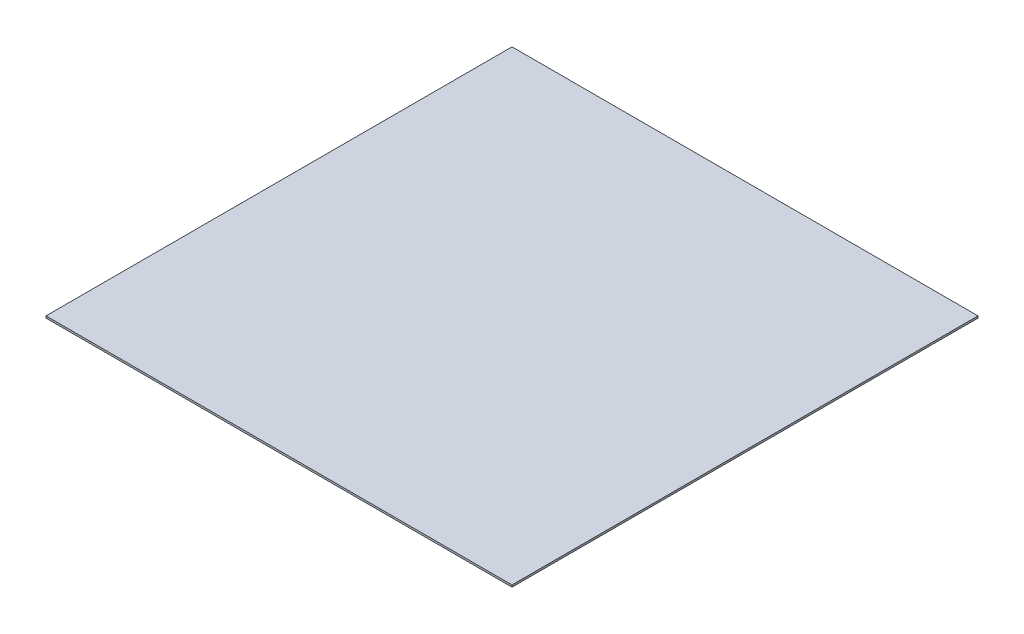
ISO-10303-21;
HEADER;
FILE_DESCRIPTION(('STEP AP214'),'2;1');
FILE_NAME('part.step','',(''),(''),'','','');
FILE_SCHEMA(('AUTOMOTIVE_DESIGN { 1 0 10303 214 1 1 1 1 }'));
ENDSEC;
DATA;
#1=APPLICATION_CONTEXT('core data for automotive mechanical design processes');
#2=APPLICATION_PROTOCOL_DEFINITION('international standard','automotive_design',2000,#1);
#3=PRODUCT_CONTEXT('',#1,'mechanical');
#4=PRODUCT('Part','Part','',(#3));
#5=PRODUCT_RELATED_PRODUCT_CATEGORY('part','',(#4));
#6=PRODUCT_DEFINITION_FORMATION('','',#4);
#7=PRODUCT_DEFINITION_CONTEXT('part definition',#1,'design');
#8=PRODUCT_DEFINITION('design','',#6,#7);
#9=PRODUCT_DEFINITION_SHAPE('','',#8);
#10=(LENGTH_UNIT() NAMED_UNIT(*) SI_UNIT(.MILLI.,.METRE.));
#11=(NAMED_UNIT(*) PLANE_ANGLE_UNIT() SI_UNIT($,.RADIAN.));
#12=(NAMED_UNIT(*) SI_UNIT($,.STERADIAN.) SOLID_ANGLE_UNIT());
#13=UNCERTAINTY_MEASURE_WITH_UNIT(LENGTH_MEASURE(1.E-05),#10,'distance_accuracy_value','');
#14=(GEOMETRIC_REPRESENTATION_CONTEXT(3) GLOBAL_UNCERTAINTY_ASSIGNED_CONTEXT((#13)) GLOBAL_UNIT_ASSIGNED_CONTEXT((#10,
#11,#12)) REPRESENTATION_CONTEXT('',''));
#15=CARTESIAN_POINT('',(0.,0.,0.));
#16=DIRECTION('',(0.,0.,1.));
#17=DIRECTION('',(1.,0.,0.));
#18=AXIS2_PLACEMENT_3D('',#15,#16,#17);
#19=CARTESIAN_POINT('',(762.,3.175,762.));
#20=DIRECTION('',(-1.,0.,0.));
#21=DIRECTION('',(0.,0.,1.));
#22=AXIS2_PLACEMENT_3D('',#19,#20,#21);
#23=PLANE('',#22);
#24=DIRECTION('',(0.,0.,-1.));
#25=VECTOR('',#24,1.);
#26=CARTESIAN_POINT('',(762.,-3.175,762.));
#27=LINE('',#26,#25);
#28=CARTESIAN_POINT('',(762.,-3.175,762.));
#29=VERTEX_POINT('',#28);
#30=CARTESIAN_POINT('',(762.,-3.175,-762.));
#31=VERTEX_POINT('',#30);
#32=EDGE_CURVE('E96',#29,#31,#27,.T.);
#33=ORIENTED_EDGE('',*,*,#32,.T.);
#34=DIRECTION('',(0.,-1.,0.));
#35=VECTOR('',#34,1.);
#36=CARTESIAN_POINT('',(762.,3.175,-762.));
#37=LINE('',#36,#35);
#38=CARTESIAN_POINT('',(762.,3.175,-762.));
#39=VERTEX_POINT('',#38);
#40=EDGE_CURVE('E11',#39,#31,#37,.T.);
#41=ORIENTED_EDGE('',*,*,#40,.F.);
#42=DIRECTION('',(0.,0.,-1.));
#43=VECTOR('',#42,1.);
#44=CARTESIAN_POINT('',(762.,3.175,762.));
#45=LINE('',#44,#43);
#46=CARTESIAN_POINT('',(762.,3.175,762.));
#47=VERTEX_POINT('',#46);
#48=EDGE_CURVE('E84',#47,#39,#45,.T.);
#49=ORIENTED_EDGE('',*,*,#48,.F.);
#50=DIRECTION('',(0.,-1.,0.));
#51=VECTOR('',#50,1.);
#52=CARTESIAN_POINT('',(762.,3.175,762.));
#53=LINE('',#52,#51);
#54=EDGE_CURVE('E92',#47,#29,#53,.T.);
#55=ORIENTED_EDGE('',*,*,#54,.T.);
#56=EDGE_LOOP('',(#33,#41,#49,#55));
#57=FACE_BOUND('',#56,.T.);
#58=ADVANCED_FACE('F33',(#57),#23,.F.);
#59=CARTESIAN_POINT('',(-762.,3.175,-762.));
#60=DIRECTION('',(0.,0.,1.));
#61=DIRECTION('',(1.,0.,0.));
#62=AXIS2_PLACEMENT_3D('',#59,#60,#61);
#63=PLANE('',#62);
#64=DIRECTION('',(-1.,0.,0.));
#65=VECTOR('',#64,1.);
#66=CARTESIAN_POINT('',(-762.,-3.175,-762.));
#67=LINE('',#66,#65);
#68=CARTESIAN_POINT('',(-762.,-3.175,-762.));
#69=VERTEX_POINT('',#68);
#70=EDGE_CURVE('E88',#31,#69,#67,.T.);
#71=ORIENTED_EDGE('',*,*,#70,.T.);
#72=DIRECTION('',(0.,-1.,0.));
#73=VECTOR('',#72,1.);
#74=CARTESIAN_POINT('',(-762.,3.175,-762.));
#75=LINE('',#74,#73);
#76=CARTESIAN_POINT('',(-762.,3.175,-762.));
#77=VERTEX_POINT('',#76);
#78=EDGE_CURVE('E41',#77,#69,#75,.T.);
#79=ORIENTED_EDGE('',*,*,#78,.F.);
#80=DIRECTION('',(-1.,0.,0.));
#81=VECTOR('',#80,1.);
#82=CARTESIAN_POINT('',(-762.,3.175,-762.));
#83=LINE('',#82,#81);
#84=EDGE_CURVE('E79',#39,#77,#83,.T.);
#85=ORIENTED_EDGE('',*,*,#84,.F.);
#86=ORIENTED_EDGE('',*,*,#40,.T.);
#87=EDGE_LOOP('',(#71,#79,#85,#86));
#88=FACE_BOUND('',#87,.T.);
#89=ADVANCED_FACE('F87',(#88),#63,.F.);
#90=CARTESIAN_POINT('',(-762.,3.175,762.));
#91=DIRECTION('',(1.,0.,0.));
#92=DIRECTION('',(0.,0.,-1.));
#93=AXIS2_PLACEMENT_3D('',#90,#91,#92);
#94=PLANE('',#93);
#95=DIRECTION('',(0.,0.,1.));
#96=VECTOR('',#95,1.);
#97=CARTESIAN_POINT('',(-762.,-3.175,762.));
#98=LINE('',#97,#96);
#99=CARTESIAN_POINT('',(-762.,-3.175,762.));
#100=VERTEX_POINT('',#99);
#101=EDGE_CURVE('E66',#69,#100,#98,.T.);
#102=ORIENTED_EDGE('',*,*,#101,.T.);
#103=DIRECTION('',(0.,-1.,0.));
#104=VECTOR('',#103,1.);
#105=CARTESIAN_POINT('',(-762.,3.175,762.));
#106=LINE('',#105,#104);
#107=CARTESIAN_POINT('',(-762.,3.175,762.));
#108=VERTEX_POINT('',#107);
#109=EDGE_CURVE('E89',#108,#100,#106,.T.);
#110=ORIENTED_EDGE('',*,*,#109,.F.);
#111=DIRECTION('',(0.,0.,1.));
#112=VECTOR('',#111,1.);
#113=CARTESIAN_POINT('',(-762.,3.175,762.));
#114=LINE('',#113,#112);
#115=EDGE_CURVE('E82',#77,#108,#114,.T.);
#116=ORIENTED_EDGE('',*,*,#115,.F.);
#117=ORIENTED_EDGE('',*,*,#78,.T.);
#118=EDGE_LOOP('',(#102,#110,#116,#117));
#119=FACE_BOUND('',#118,.T.);
#120=ADVANCED_FACE('F90',(#119),#94,.F.);
#121=CARTESIAN_POINT('',(-762.,3.175,762.));
#122=DIRECTION('',(0.,0.,-1.));
#123=DIRECTION('',(-1.,0.,0.));
#124=AXIS2_PLACEMENT_3D('',#121,#122,#123);
#125=PLANE('',#124);
#126=DIRECTION('',(1.,0.,0.));
#127=VECTOR('',#126,1.);
#128=CARTESIAN_POINT('',(-762.,-3.175,762.));
#129=LINE('',#128,#127);
#130=EDGE_CURVE('E72',#100,#29,#129,.T.);
#131=ORIENTED_EDGE('',*,*,#130,.T.);
#132=ORIENTED_EDGE('',*,*,#54,.F.);
#133=DIRECTION('',(1.,0.,0.));
#134=VECTOR('',#133,1.);
#135=CARTESIAN_POINT('',(-762.,3.175,762.));
#136=LINE('',#135,#134);
#137=EDGE_CURVE('E49',#108,#47,#136,.T.);
#138=ORIENTED_EDGE('',*,*,#137,.F.);
#139=ORIENTED_EDGE('',*,*,#109,.T.);
#140=EDGE_LOOP('',(#131,#132,#138,#139));
#141=FACE_BOUND('',#140,.T.);
#142=ADVANCED_FACE('F103',(#141),#125,.F.);
#143=CARTESIAN_POINT('',(0.,3.175,0.));
#144=DIRECTION('',(0.,-1.,0.));
#145=DIRECTION('',(0.,0.,-1.));
#146=AXIS2_PLACEMENT_3D('',#143,#144,#145);
#147=PLANE('',#146);
#148=ORIENTED_EDGE('',*,*,#48,.T.);
#149=ORIENTED_EDGE('',*,*,#84,.T.);
#150=ORIENTED_EDGE('',*,*,#115,.T.);
#151=ORIENTED_EDGE('',*,*,#137,.T.);
#152=EDGE_LOOP('',(#148,#149,#150,#151));
#153=FACE_BOUND('',#152,.T.);
#154=ADVANCED_FACE('F80',(#153),#147,.F.);
#155=CARTESIAN_POINT('',(0.,-3.175,0.));
#156=DIRECTION('',(0.,-1.,0.));
#157=DIRECTION('',(0.,0.,-1.));
#158=AXIS2_PLACEMENT_3D('',#155,#156,#157);
#159=PLANE('',#158);
#160=ORIENTED_EDGE('',*,*,#32,.F.);
#161=ORIENTED_EDGE('',*,*,#130,.F.);
#162=ORIENTED_EDGE('',*,*,#101,.F.);
#163=ORIENTED_EDGE('',*,*,#70,.F.);
#164=EDGE_LOOP('',(#160,#161,#162,#163));
#165=FACE_BOUND('',#164,.T.);
#166=ADVANCED_FACE('F106',(#165),#159,.T.);
#167=CLOSED_SHELL('',(#58,#89,#120,#142,#154,#166));
#168=MANIFOLD_SOLID_BREP('B2',#167);
#169=ADVANCED_BREP_SHAPE_REPRESENTATION('',(#18,#168),#14);
#170=SHAPE_DEFINITION_REPRESENTATION(#9,#169);
ENDSEC;
END-ISO-10303-21;
